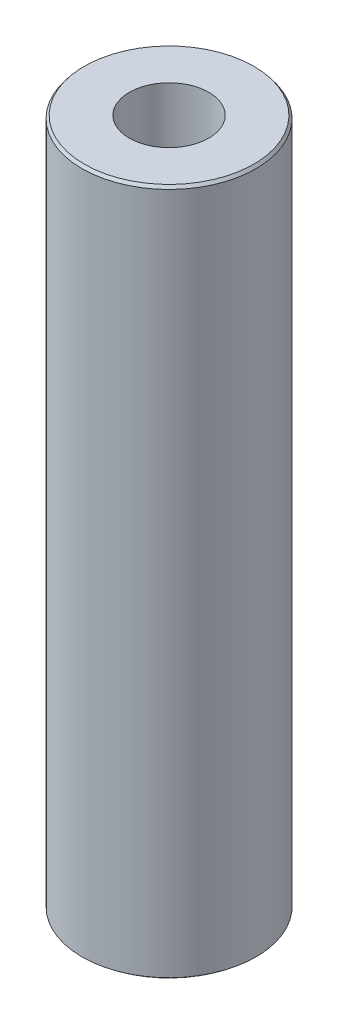
ISO-10303-21;
HEADER;
FILE_DESCRIPTION(('STEP AP214'),'2;1');
FILE_NAME('part.step','',(''),(''),'','','');
FILE_SCHEMA(('AUTOMOTIVE_DESIGN { 1 0 10303 214 1 1 1 1 }'));
ENDSEC;
DATA;
#1=APPLICATION_CONTEXT('core data for automotive mechanical design processes');
#2=APPLICATION_PROTOCOL_DEFINITION('international standard','automotive_design',2000,#1);
#3=PRODUCT_CONTEXT('',#1,'mechanical');
#4=PRODUCT('Part','Part','',(#3));
#5=PRODUCT_RELATED_PRODUCT_CATEGORY('part','',(#4));
#6=PRODUCT_DEFINITION_FORMATION('','',#4);
#7=PRODUCT_DEFINITION_CONTEXT('part definition',#1,'design');
#8=PRODUCT_DEFINITION('design','',#6,#7);
#9=PRODUCT_DEFINITION_SHAPE('','',#8);
#10=(LENGTH_UNIT() NAMED_UNIT(*) SI_UNIT(.MILLI.,.METRE.));
#11=(NAMED_UNIT(*) PLANE_ANGLE_UNIT() SI_UNIT($,.RADIAN.));
#12=(NAMED_UNIT(*) SI_UNIT($,.STERADIAN.) SOLID_ANGLE_UNIT());
#13=UNCERTAINTY_MEASURE_WITH_UNIT(LENGTH_MEASURE(1.E-05),#10,'distance_accuracy_value','');
#14=(GEOMETRIC_REPRESENTATION_CONTEXT(3) GLOBAL_UNCERTAINTY_ASSIGNED_CONTEXT((#13)) GLOBAL_UNIT_ASSIGNED_CONTEXT((#10,
#11,#12)) REPRESENTATION_CONTEXT('',''));
#15=CARTESIAN_POINT('',(0.,0.,0.));
#16=DIRECTION('',(0.,0.,1.));
#17=DIRECTION('',(1.,0.,0.));
#18=AXIS2_PLACEMENT_3D('',#15,#16,#17);
#19=CARTESIAN_POINT('',(0.,395.223196319845,0.));
#20=DIRECTION('',(0.,-1.,0.));
#21=DIRECTION('',(0.,0.,-1.));
#22=AXIS2_PLACEMENT_3D('',#19,#20,#21);
#23=CYLINDRICAL_SURFACE('',#22,50.);
#24=CARTESIAN_POINT('',(0.,393.613370931993,0.));
#25=DIRECTION('',(0.,1.,0.));
#26=DIRECTION('',(0.,0.,1.));
#27=AXIS2_PLACEMENT_3D('',#24,#25,#26);
#28=CIRCLE('',#27,50.);
#29=CARTESIAN_POINT('',(0.,393.613370931993,50.));
#30=VERTEX_POINT('',#29);
#31=EDGE_CURVE('E50',#30,#30,#28,.F.);
#32=ORIENTED_EDGE('',*,*,#31,.T.);
#33=EDGE_LOOP('',(#32));
#34=FACE_BOUND('',#33,.T.);
#35=CARTESIAN_POINT('',(0.,1.26218484770835,0.));
#36=DIRECTION('',(0.,1.,0.));
#37=DIRECTION('',(0.,0.,1.));
#38=AXIS2_PLACEMENT_3D('',#35,#36,#37);
#39=CIRCLE('',#38,50.);
#40=CARTESIAN_POINT('',(0.,1.26218484770835,50.));
#41=VERTEX_POINT('',#40);
#42=EDGE_CURVE('E51',#41,#41,#39,.T.);
#43=ORIENTED_EDGE('',*,*,#42,.T.);
#44=EDGE_LOOP('',(#43));
#45=FACE_BOUND('',#44,.T.);
#46=ADVANCED_FACE('F39',(#34,#45),#23,.T.);
#47=CARTESIAN_POINT('',(0.,395.223196319845,0.));
#48=DIRECTION('',(0.,1.,0.));
#49=DIRECTION('',(0.,0.,1.));
#50=AXIS2_PLACEMENT_3D('',#47,#48,#49);
#51=PLANE('',#50);
#52=CARTESIAN_POINT('',(0.,395.223196319845,0.));
#53=DIRECTION('',(0.,1.,0.));
#54=DIRECTION('',(0.,0.,1.));
#55=AXIS2_PLACEMENT_3D('',#52,#53,#54);
#56=CIRCLE('',#55,48.7378151522916);
#57=CARTESIAN_POINT('',(0.,395.223196319845,48.7378151522916));
#58=VERTEX_POINT('',#57);
#59=EDGE_CURVE('E54',#58,#58,#56,.T.);
#60=ORIENTED_EDGE('',*,*,#59,.T.);
#61=EDGE_LOOP('',(#60));
#62=FACE_BOUND('',#61,.T.);
#63=CARTESIAN_POINT('',(0.,395.223196319845,0.));
#64=DIRECTION('',(0.,1.,0.));
#65=DIRECTION('',(0.,0.,1.));
#66=AXIS2_PLACEMENT_3D('',#63,#64,#65);
#67=CIRCLE('',#66,22.8402808952242);
#68=CARTESIAN_POINT('',(0.,395.223196319845,22.8402808952242));
#69=VERTEX_POINT('',#68);
#70=EDGE_CURVE('E58',#69,#69,#67,.T.);
#71=ORIENTED_EDGE('',*,*,#70,.F.);
#72=EDGE_LOOP('',(#71));
#73=FACE_BOUND('',#72,.T.);
#74=ADVANCED_FACE('F69',(#62,#73),#51,.T.);
#75=CARTESIAN_POINT('',(0.,0.,0.));
#76=DIRECTION('',(0.,1.,0.));
#77=DIRECTION('',(0.,0.,1.));
#78=AXIS2_PLACEMENT_3D('',#75,#76,#77);
#79=PLANE('',#78);
#80=CARTESIAN_POINT('',(0.,0.,0.));
#81=DIRECTION('',(0.,1.,0.));
#82=DIRECTION('',(0.,0.,1.));
#83=AXIS2_PLACEMENT_3D('',#80,#81,#82);
#84=CIRCLE('',#83,48.3901746121478);
#85=CARTESIAN_POINT('',(0.,0.,48.3901746121478));
#86=VERTEX_POINT('',#85);
#87=EDGE_CURVE('E10',#86,#86,#84,.F.);
#88=ORIENTED_EDGE('',*,*,#87,.T.);
#89=EDGE_LOOP('',(#88));
#90=FACE_BOUND('',#89,.T.);
#91=CARTESIAN_POINT('',(0.,0.,0.));
#92=DIRECTION('',(0.,1.,0.));
#93=DIRECTION('',(0.,0.,1.));
#94=AXIS2_PLACEMENT_3D('',#91,#92,#93);
#95=CIRCLE('',#94,22.8402808952242);
#96=CARTESIAN_POINT('',(0.,0.,22.8402808952242));
#97=VERTEX_POINT('',#96);
#98=EDGE_CURVE('E63',#97,#97,#95,.T.);
#99=ORIENTED_EDGE('',*,*,#98,.T.);
#100=EDGE_LOOP('',(#99));
#101=FACE_BOUND('',#100,.T.);
#102=ADVANCED_FACE('F75',(#90,#101),#79,.F.);
#103=CARTESIAN_POINT('',(0.,395.223196319845,0.));
#104=DIRECTION('',(0.,-1.,0.));
#105=DIRECTION('',(0.,0.,-1.));
#106=AXIS2_PLACEMENT_3D('',#103,#104,#105);
#107=CYLINDRICAL_SURFACE('',#106,22.8402808952242);
#108=ORIENTED_EDGE('',*,*,#70,.T.);
#109=EDGE_LOOP('',(#108));
#110=FACE_BOUND('',#109,.T.);
#111=ORIENTED_EDGE('',*,*,#98,.F.);
#112=EDGE_LOOP('',(#111));
#113=FACE_BOUND('',#112,.T.);
#114=ADVANCED_FACE('F70',(#110,#113),#107,.F.);
#115=CARTESIAN_POINT('',(0.,395.223196319845,0.));
#116=DIRECTION('',(0.,-1.,0.));
#117=DIRECTION('',(0.,0.,-1.));
#118=AXIS2_PLACEMENT_3D('',#115,#116,#117);
#119=CONICAL_SURFACE('',#118,48.7378151522916,0.66493986478726);
#120=ORIENTED_EDGE('',*,*,#31,.F.);
#121=EDGE_LOOP('',(#120));
#122=FACE_BOUND('',#121,.T.);
#123=ORIENTED_EDGE('',*,*,#59,.F.);
#124=EDGE_LOOP('',(#123));
#125=FACE_BOUND('',#124,.T.);
#126=ADVANCED_FACE('F81',(#122,#125),#119,.T.);
#127=CARTESIAN_POINT('',(0.,1.26218484770835,0.));
#128=DIRECTION('',(0.,1.,0.));
#129=DIRECTION('',(0.,0.,1.));
#130=AXIS2_PLACEMENT_3D('',#127,#128,#129);
#131=CONICAL_SURFACE('',#130,50.,0.905856462007612);
#132=ORIENTED_EDGE('',*,*,#87,.F.);
#133=EDGE_LOOP('',(#132));
#134=FACE_BOUND('',#133,.T.);
#135=ORIENTED_EDGE('',*,*,#42,.F.);
#136=EDGE_LOOP('',(#135));
#137=FACE_BOUND('',#136,.T.);
#138=ADVANCED_FACE('F45',(#134,#137),#131,.T.);
#139=CLOSED_SHELL('',(#46,#74,#102,#114,#126,#138));
#140=MANIFOLD_SOLID_BREP('B2',#139);
#141=ADVANCED_BREP_SHAPE_REPRESENTATION('',(#18,#140),#14);
#142=SHAPE_DEFINITION_REPRESENTATION(#9,#141);
ENDSEC;
END-ISO-10303-21;
